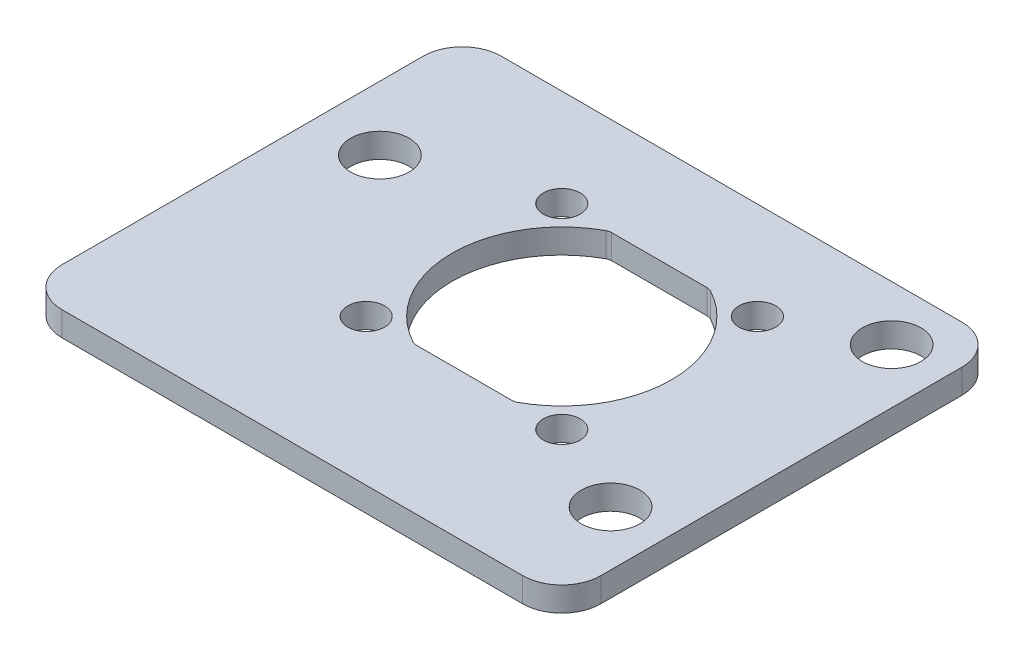
ISO-10303-21;
HEADER;
FILE_DESCRIPTION(('STEP AP214'),'2;1');
FILE_NAME('part.step','',(''),(''),'','','');
FILE_SCHEMA(('AUTOMOTIVE_DESIGN { 1 0 10303 214 1 1 1 1 }'));
ENDSEC;
DATA;
#1=APPLICATION_CONTEXT('core data for automotive mechanical design processes');
#2=APPLICATION_PROTOCOL_DEFINITION('international standard','automotive_design',2000,#1);
#3=PRODUCT_CONTEXT('',#1,'mechanical');
#4=PRODUCT('Part','Part','',(#3));
#5=PRODUCT_RELATED_PRODUCT_CATEGORY('part','',(#4));
#6=PRODUCT_DEFINITION_FORMATION('','',#4);
#7=PRODUCT_DEFINITION_CONTEXT('part definition',#1,'design');
#8=PRODUCT_DEFINITION('design','',#6,#7);
#9=PRODUCT_DEFINITION_SHAPE('','',#8);
#10=(LENGTH_UNIT() NAMED_UNIT(*) SI_UNIT(.MILLI.,.METRE.));
#11=(NAMED_UNIT(*) PLANE_ANGLE_UNIT() SI_UNIT($,.RADIAN.));
#12=(NAMED_UNIT(*) SI_UNIT($,.STERADIAN.) SOLID_ANGLE_UNIT());
#13=UNCERTAINTY_MEASURE_WITH_UNIT(LENGTH_MEASURE(1.E-05),#10,'distance_accuracy_value','');
#14=(GEOMETRIC_REPRESENTATION_CONTEXT(3) GLOBAL_UNCERTAINTY_ASSIGNED_CONTEXT((#13)) GLOBAL_UNIT_ASSIGNED_CONTEXT((#10,
#11,#12)) REPRESENTATION_CONTEXT('',''));
#15=CARTESIAN_POINT('',(0.,0.,0.));
#16=DIRECTION('',(0.,0.,1.));
#17=DIRECTION('',(1.,0.,0.));
#18=AXIS2_PLACEMENT_3D('',#15,#16,#17);
#19=CARTESIAN_POINT('',(0.,1.5875,0.));
#20=DIRECTION('',(0.,-1.,0.));
#21=DIRECTION('',(0.,0.,-1.));
#22=AXIS2_PLACEMENT_3D('',#19,#20,#21);
#23=CYLINDRICAL_SURFACE('',#22,7.1374);
#24=CARTESIAN_POINT('',(0.,1.5875,0.));
#25=DIRECTION('',(0.,1.,0.));
#26=DIRECTION('',(0.,0.,1.));
#27=AXIS2_PLACEMENT_3D('',#24,#25,#26);
#28=CIRCLE('',#27,7.1374);
#29=CARTESIAN_POINT('',(3.40450092347453,1.5875,6.27310546874999));
#30=VERTEX_POINT('',#29);
#31=CARTESIAN_POINT('',(3.40450092347453,1.5875,-6.27310546875));
#32=VERTEX_POINT('',#31);
#33=EDGE_CURVE('E179',#30,#32,#28,.T.);
#34=ORIENTED_EDGE('',*,*,#33,.T.);
#35=DIRECTION('',(0.,-1.,0.));
#36=VECTOR('',#35,1.);
#37=CARTESIAN_POINT('',(3.40450092347453,1.5875,-6.27310546875001));
#38=LINE('',#37,#36);
#39=CARTESIAN_POINT('',(3.40450092347453,0.,-6.27310546875));
#40=VERTEX_POINT('',#39);
#41=EDGE_CURVE('E201',#32,#40,#38,.T.);
#42=ORIENTED_EDGE('',*,*,#41,.T.);
#43=CARTESIAN_POINT('',(0.,0.,0.));
#44=DIRECTION('',(0.,1.,0.));
#45=DIRECTION('',(0.,0.,1.));
#46=AXIS2_PLACEMENT_3D('',#43,#44,#45);
#47=CIRCLE('',#46,7.1374);
#48=CARTESIAN_POINT('',(3.40450092347453,0.,6.27310546874999));
#49=VERTEX_POINT('',#48);
#50=EDGE_CURVE('E180',#49,#40,#47,.T.);
#51=ORIENTED_EDGE('',*,*,#50,.F.);
#52=DIRECTION('',(0.,-1.,0.));
#53=VECTOR('',#52,1.);
#54=CARTESIAN_POINT('',(3.40450092347453,1.5875,6.27310546874999));
#55=LINE('',#54,#53);
#56=EDGE_CURVE('E197',#49,#30,#55,.F.);
#57=ORIENTED_EDGE('',*,*,#56,.T.);
#58=EDGE_LOOP('',(#34,#42,#51,#57));
#59=FACE_BOUND('',#58,.T.);
#60=ADVANCED_FACE('F39',(#59),#23,.F.);
#61=CARTESIAN_POINT('',(0.,1.5875,0.));
#62=DIRECTION('',(0.,-1.,0.));
#63=DIRECTION('',(0.,0.,-1.));
#64=AXIS2_PLACEMENT_3D('',#61,#62,#63);
#65=PLANE('',#64);
#66=CARTESIAN_POINT('',(-15.0096592899373,1.5875,-3.175));
#67=DIRECTION('',(0.,-1.,0.));
#68=DIRECTION('',(0.,0.,1.));
#69=AXIS2_PLACEMENT_3D('',#66,#67,#68);
#70=CIRCLE('',#69,1.905);
#71=CARTESIAN_POINT('',(-15.0096592899373,1.5875,-1.27));
#72=VERTEX_POINT('',#71);
#73=EDGE_CURVE('E381',#72,#72,#70,.T.);
#74=ORIENTED_EDGE('',*,*,#73,.T.);
#75=EDGE_LOOP('',(#74));
#76=FACE_BOUND('',#75,.T.);
#77=DIRECTION('',(0.,0.,-1.));
#78=VECTOR('',#77,1.);
#79=CARTESIAN_POINT('',(15.875,1.5875,12.7));
#80=LINE('',#79,#78);
#81=CARTESIAN_POINT('',(15.875,1.5875,13.335));
#82=VERTEX_POINT('',#81);
#83=CARTESIAN_POINT('',(15.875,1.5875,-10.16));
#84=VERTEX_POINT('',#83);
#85=EDGE_CURVE('E350',#82,#84,#80,.T.);
#86=ORIENTED_EDGE('',*,*,#85,.T.);
#87=CARTESIAN_POINT('',(13.335,1.5875,-10.16));
#88=DIRECTION('',(0.,-1.,0.));
#89=DIRECTION('',(0.,0.,-1.));
#90=AXIS2_PLACEMENT_3D('',#87,#88,#89);
#91=CIRCLE('',#90,2.54);
#92=CARTESIAN_POINT('',(13.335,1.5875,-12.7));
#93=VERTEX_POINT('',#92);
#94=EDGE_CURVE('E263',#84,#93,#91,.F.);
#95=ORIENTED_EDGE('',*,*,#94,.T.);
#96=DIRECTION('',(-1.,0.,0.));
#97=VECTOR('',#96,1.);
#98=CARTESIAN_POINT('',(-15.875,1.5875,-12.7));
#99=LINE('',#98,#97);
#100=CARTESIAN_POINT('',(-16.637,1.5875,-12.7));
#101=VERTEX_POINT('',#100);
#102=EDGE_CURVE('E191',#93,#101,#99,.T.);
#103=ORIENTED_EDGE('',*,*,#102,.T.);
#104=CARTESIAN_POINT('',(-16.637,1.5875,-10.16));
#105=DIRECTION('',(0.,-1.,0.));
#106=DIRECTION('',(0.,0.,-1.));
#107=AXIS2_PLACEMENT_3D('',#104,#105,#106);
#108=CIRCLE('',#107,2.54);
#109=CARTESIAN_POINT('',(-19.177,1.5875,-10.16));
#110=VERTEX_POINT('',#109);
#111=EDGE_CURVE('E260',#101,#110,#108,.F.);
#112=ORIENTED_EDGE('',*,*,#111,.T.);
#113=DIRECTION('',(0.,0.,1.));
#114=VECTOR('',#113,1.);
#115=CARTESIAN_POINT('',(-19.177,1.5875,-12.7));
#116=LINE('',#115,#114);
#117=CARTESIAN_POINT('',(-19.177,1.5875,13.335));
#118=VERTEX_POINT('',#117);
#119=EDGE_CURVE('E374',#110,#118,#116,.T.);
#120=ORIENTED_EDGE('',*,*,#119,.T.);
#121=CARTESIAN_POINT('',(-16.637,1.5875,13.335));
#122=DIRECTION('',(0.,-1.,0.));
#123=DIRECTION('',(0.,0.,-1.));
#124=AXIS2_PLACEMENT_3D('',#121,#122,#123);
#125=CIRCLE('',#124,2.54);
#126=CARTESIAN_POINT('',(-16.637,1.5875,15.875));
#127=VERTEX_POINT('',#126);
#128=EDGE_CURVE('E63',#118,#127,#125,.F.);
#129=ORIENTED_EDGE('',*,*,#128,.T.);
#130=DIRECTION('',(1.,0.,0.));
#131=VECTOR('',#130,1.);
#132=CARTESIAN_POINT('',(-15.875,1.5875,15.875));
#133=LINE('',#132,#131);
#134=CARTESIAN_POINT('',(13.335,1.5875,15.875));
#135=VERTEX_POINT('',#134);
#136=EDGE_CURVE('E276',#127,#135,#133,.T.);
#137=ORIENTED_EDGE('',*,*,#136,.T.);
#138=CARTESIAN_POINT('',(13.335,1.5875,13.335));
#139=DIRECTION('',(0.,-1.,0.));
#140=DIRECTION('',(0.,0.,-1.));
#141=AXIS2_PLACEMENT_3D('',#138,#139,#140);
#142=CIRCLE('',#141,2.54);
#143=EDGE_CURVE('E55',#135,#82,#142,.F.);
#144=ORIENTED_EDGE('',*,*,#143,.T.);
#145=EDGE_LOOP('',(#86,#95,#103,#112,#120,#129,#137,#144));
#146=FACE_BOUND('',#145,.T.);
#147=CARTESIAN_POINT('',(-3.40450092347451,1.5875,-6.27310546875));
#148=VERTEX_POINT('',#147);
#149=CARTESIAN_POINT('',(-3.40450092347451,1.5875,6.27310546874999));
#150=VERTEX_POINT('',#149);
#151=EDGE_CURVE('E346',#148,#150,#28,.T.);
#152=ORIENTED_EDGE('',*,*,#151,.F.);
#153=CARTESIAN_POINT('',(-3.10160938224012,1.5875,-5.71500000000001));
#154=DIRECTION('',(0.,-1.,0.));
#155=DIRECTION('',(0.,0.,-1.));
#156=AXIS2_PLACEMENT_3D('',#153,#154,#155);
#157=CIRCLE('',#156,0.635);
#158=CARTESIAN_POINT('',(-3.10160938224012,1.5875,-6.35));
#159=VERTEX_POINT('',#158);
#160=EDGE_CURVE('E168',#148,#159,#157,.T.);
#161=ORIENTED_EDGE('',*,*,#160,.T.);
#162=DIRECTION('',(1.,0.,0.));
#163=VECTOR('',#162,1.);
#164=CARTESIAN_POINT('',(-3.25883088852428,1.5875,-6.35));
#165=LINE('',#164,#163);
#166=CARTESIAN_POINT('',(3.10160938224014,1.5875,-6.35));
#167=VERTEX_POINT('',#166);
#168=EDGE_CURVE('E386',#159,#167,#165,.T.);
#169=ORIENTED_EDGE('',*,*,#168,.T.);
#170=CARTESIAN_POINT('',(3.10160938224014,1.5875,-5.71500000000001));
#171=DIRECTION('',(0.,-1.,0.));
#172=DIRECTION('',(0.,0.,-1.));
#173=AXIS2_PLACEMENT_3D('',#170,#171,#172);
#174=CIRCLE('',#173,0.635);
#175=EDGE_CURVE('E167',#167,#32,#174,.T.);
#176=ORIENTED_EDGE('',*,*,#175,.T.);
#177=ORIENTED_EDGE('',*,*,#33,.F.);
#178=CARTESIAN_POINT('',(3.10160938224014,1.5875,5.71499999999999));
#179=DIRECTION('',(0.,-1.,0.));
#180=DIRECTION('',(0.,0.,-1.));
#181=AXIS2_PLACEMENT_3D('',#178,#179,#180);
#182=CIRCLE('',#181,0.635);
#183=CARTESIAN_POINT('',(3.10160938224014,1.5875,6.34999999999999));
#184=VERTEX_POINT('',#183);
#185=EDGE_CURVE('E224',#30,#184,#182,.T.);
#186=ORIENTED_EDGE('',*,*,#185,.T.);
#187=DIRECTION('',(-1.,0.,0.));
#188=VECTOR('',#187,1.);
#189=CARTESIAN_POINT('',(3.25883088852428,1.5875,6.34999999999999));
#190=LINE('',#189,#188);
#191=CARTESIAN_POINT('',(-3.10160938224012,1.5875,6.34999999999999));
#192=VERTEX_POINT('',#191);
#193=EDGE_CURVE('E395',#184,#192,#190,.T.);
#194=ORIENTED_EDGE('',*,*,#193,.T.);
#195=CARTESIAN_POINT('',(-3.10160938224012,1.5875,5.71499999999999));
#196=DIRECTION('',(0.,-1.,0.));
#197=DIRECTION('',(0.,0.,-1.));
#198=AXIS2_PLACEMENT_3D('',#195,#196,#197);
#199=CIRCLE('',#198,0.635);
#200=EDGE_CURVE('E218',#192,#150,#199,.T.);
#201=ORIENTED_EDGE('',*,*,#200,.T.);
#202=EDGE_LOOP('',(#152,#161,#169,#176,#177,#186,#194,#201));
#203=FACE_BOUND('',#202,.T.);
#204=CARTESIAN_POINT('',(-6.36396103067893,1.5875,6.36396103067893));
#205=DIRECTION('',(0.,1.,0.));
#206=DIRECTION('',(0.,0.,1.));
#207=AXIS2_PLACEMENT_3D('',#204,#205,#206);
#208=CIRCLE('',#207,1.2);
#209=CARTESIAN_POINT('',(-6.36396103067893,1.5875,7.56396103067893));
#210=VERTEX_POINT('',#209);
#211=EDGE_CURVE('E337',#210,#210,#208,.T.);
#212=ORIENTED_EDGE('',*,*,#211,.F.);
#213=EDGE_LOOP('',(#212));
#214=FACE_BOUND('',#213,.T.);
#215=CARTESIAN_POINT('',(-6.36396103067893,1.5875,-6.36396103067893));
#216=DIRECTION('',(0.,1.,0.));
#217=DIRECTION('',(0.,0.,1.));
#218=AXIS2_PLACEMENT_3D('',#215,#216,#217);
#219=CIRCLE('',#218,1.2);
#220=CARTESIAN_POINT('',(-6.36396103067893,1.5875,-5.16396103067893));
#221=VERTEX_POINT('',#220);
#222=EDGE_CURVE('E329',#221,#221,#219,.T.);
#223=ORIENTED_EDGE('',*,*,#222,.F.);
#224=EDGE_LOOP('',(#223));
#225=FACE_BOUND('',#224,.T.);
#226=CARTESIAN_POINT('',(6.36396103067893,1.5875,-6.36396103067893));
#227=DIRECTION('',(0.,1.,0.));
#228=DIRECTION('',(0.,0.,1.));
#229=AXIS2_PLACEMENT_3D('',#226,#227,#228);
#230=CIRCLE('',#229,1.2);
#231=CARTESIAN_POINT('',(6.36396103067893,1.5875,-5.16396103067893));
#232=VERTEX_POINT('',#231);
#233=EDGE_CURVE('E321',#232,#232,#230,.T.);
#234=ORIENTED_EDGE('',*,*,#233,.F.);
#235=EDGE_LOOP('',(#234));
#236=FACE_BOUND('',#235,.T.);
#237=CARTESIAN_POINT('',(6.36396103067893,1.5875,6.36396103067893));
#238=DIRECTION('',(0.,1.,0.));
#239=DIRECTION('',(0.,0.,1.));
#240=AXIS2_PLACEMENT_3D('',#237,#238,#239);
#241=CIRCLE('',#240,1.2);
#242=CARTESIAN_POINT('',(6.36396103067893,1.5875,7.56396103067893));
#243=VERTEX_POINT('',#242);
#244=EDGE_CURVE('E313',#243,#243,#241,.T.);
#245=ORIENTED_EDGE('',*,*,#244,.F.);
#246=EDGE_LOOP('',(#245));
#247=FACE_BOUND('',#246,.T.);
#248=CARTESIAN_POINT('',(12.319,1.5875,-9.144));
#249=DIRECTION('',(0.,1.,0.));
#250=DIRECTION('',(0.,0.,1.));
#251=AXIS2_PLACEMENT_3D('',#248,#249,#250);
#252=CIRCLE('',#251,1.905);
#253=CARTESIAN_POINT('',(12.319,1.5875,-7.239));
#254=VERTEX_POINT('',#253);
#255=EDGE_CURVE('E305',#254,#254,#252,.T.);
#256=ORIENTED_EDGE('',*,*,#255,.F.);
#257=EDGE_LOOP('',(#256));
#258=FACE_BOUND('',#257,.T.);
#259=CARTESIAN_POINT('',(12.319,1.5875,9.144));
#260=DIRECTION('',(0.,1.,0.));
#261=DIRECTION('',(0.,0.,1.));
#262=AXIS2_PLACEMENT_3D('',#259,#260,#261);
#263=CIRCLE('',#262,1.905);
#264=CARTESIAN_POINT('',(12.319,1.5875,11.049));
#265=VERTEX_POINT('',#264);
#266=EDGE_CURVE('E297',#265,#265,#263,.T.);
#267=ORIENTED_EDGE('',*,*,#266,.F.);
#268=EDGE_LOOP('',(#267));
#269=FACE_BOUND('',#268,.T.);
#270=ADVANCED_FACE('F282',(#76,#146,#203,#214,#225,#236,#247,#258,#269),#65,.F.);
#271=CARTESIAN_POINT('',(0.,0.,0.));
#272=DIRECTION('',(0.,-1.,0.));
#273=DIRECTION('',(0.,0.,-1.));
#274=AXIS2_PLACEMENT_3D('',#271,#272,#273);
#275=PLANE('',#274);
#276=CARTESIAN_POINT('',(-15.0096592899373,0.,-3.175));
#277=DIRECTION('',(0.,-1.,0.));
#278=DIRECTION('',(0.,0.,1.));
#279=AXIS2_PLACEMENT_3D('',#276,#277,#278);
#280=CIRCLE('',#279,1.905);
#281=CARTESIAN_POINT('',(-15.0096592899373,0.,-1.27));
#282=VERTEX_POINT('',#281);
#283=EDGE_CURVE('E286',#282,#282,#280,.T.);
#284=ORIENTED_EDGE('',*,*,#283,.F.);
#285=EDGE_LOOP('',(#284));
#286=FACE_BOUND('',#285,.T.);
#287=CARTESIAN_POINT('',(12.319,0.,-9.144));
#288=DIRECTION('',(0.,1.,0.));
#289=DIRECTION('',(0.,0.,1.));
#290=AXIS2_PLACEMENT_3D('',#287,#288,#289);
#291=CIRCLE('',#290,1.905);
#292=CARTESIAN_POINT('',(12.319,0.,-7.239));
#293=VERTEX_POINT('',#292);
#294=EDGE_CURVE('E301',#293,#293,#291,.T.);
#295=ORIENTED_EDGE('',*,*,#294,.T.);
#296=EDGE_LOOP('',(#295));
#297=FACE_BOUND('',#296,.T.);
#298=CARTESIAN_POINT('',(6.36396103067893,0.,-6.36396103067893));
#299=DIRECTION('',(0.,1.,0.));
#300=DIRECTION('',(0.,0.,1.));
#301=AXIS2_PLACEMENT_3D('',#298,#299,#300);
#302=CIRCLE('',#301,1.2);
#303=CARTESIAN_POINT('',(6.36396103067893,0.,-5.16396103067893));
#304=VERTEX_POINT('',#303);
#305=EDGE_CURVE('E317',#304,#304,#302,.T.);
#306=ORIENTED_EDGE('',*,*,#305,.T.);
#307=EDGE_LOOP('',(#306));
#308=FACE_BOUND('',#307,.T.);
#309=CARTESIAN_POINT('',(-6.36396103067893,0.,6.36396103067893));
#310=DIRECTION('',(0.,1.,0.));
#311=DIRECTION('',(0.,0.,1.));
#312=AXIS2_PLACEMENT_3D('',#309,#310,#311);
#313=CIRCLE('',#312,1.2);
#314=CARTESIAN_POINT('',(-6.36396103067893,0.,7.56396103067893));
#315=VERTEX_POINT('',#314);
#316=EDGE_CURVE('E333',#315,#315,#313,.T.);
#317=ORIENTED_EDGE('',*,*,#316,.T.);
#318=EDGE_LOOP('',(#317));
#319=FACE_BOUND('',#318,.T.);
#320=DIRECTION('',(-1.,0.,0.));
#321=VECTOR('',#320,1.);
#322=CARTESIAN_POINT('',(-15.875,0.,-12.7));
#323=LINE('',#322,#321);
#324=CARTESIAN_POINT('',(13.335,0.,-12.7));
#325=VERTEX_POINT('',#324);
#326=CARTESIAN_POINT('',(-16.637,0.,-12.7));
#327=VERTEX_POINT('',#326);
#328=EDGE_CURVE('E353',#325,#327,#323,.T.);
#329=ORIENTED_EDGE('',*,*,#328,.F.);
#330=CARTESIAN_POINT('',(13.335,0.,-10.16));
#331=DIRECTION('',(0.,-1.,0.));
#332=DIRECTION('',(0.,0.,-1.));
#333=AXIS2_PLACEMENT_3D('',#330,#331,#332);
#334=CIRCLE('',#333,2.54);
#335=CARTESIAN_POINT('',(15.875,0.,-10.16));
#336=VERTEX_POINT('',#335);
#337=EDGE_CURVE('E247',#325,#336,#334,.T.);
#338=ORIENTED_EDGE('',*,*,#337,.T.);
#339=DIRECTION('',(0.,0.,-1.));
#340=VECTOR('',#339,1.);
#341=CARTESIAN_POINT('',(15.875,0.,12.7));
#342=LINE('',#341,#340);
#343=CARTESIAN_POINT('',(15.875,0.,13.335));
#344=VERTEX_POINT('',#343);
#345=EDGE_CURVE('E357',#344,#336,#342,.T.);
#346=ORIENTED_EDGE('',*,*,#345,.F.);
#347=CARTESIAN_POINT('',(13.335,0.,13.335));
#348=DIRECTION('',(0.,-1.,0.));
#349=DIRECTION('',(0.,0.,-1.));
#350=AXIS2_PLACEMENT_3D('',#347,#348,#349);
#351=CIRCLE('',#350,2.54);
#352=CARTESIAN_POINT('',(13.335,0.,15.875));
#353=VERTEX_POINT('',#352);
#354=EDGE_CURVE('E238',#344,#353,#351,.T.);
#355=ORIENTED_EDGE('',*,*,#354,.T.);
#356=DIRECTION('',(1.,0.,0.));
#357=VECTOR('',#356,1.);
#358=CARTESIAN_POINT('',(-15.875,0.,15.875));
#359=LINE('',#358,#357);
#360=CARTESIAN_POINT('',(-16.637,0.,15.875));
#361=VERTEX_POINT('',#360);
#362=EDGE_CURVE('E279',#361,#353,#359,.T.);
#363=ORIENTED_EDGE('',*,*,#362,.F.);
#364=CARTESIAN_POINT('',(-16.637,0.,13.335));
#365=DIRECTION('',(0.,-1.,0.));
#366=DIRECTION('',(0.,0.,-1.));
#367=AXIS2_PLACEMENT_3D('',#364,#365,#366);
#368=CIRCLE('',#367,2.54);
#369=CARTESIAN_POINT('',(-19.177,0.,13.335));
#370=VERTEX_POINT('',#369);
#371=EDGE_CURVE('E241',#361,#370,#368,.T.);
#372=ORIENTED_EDGE('',*,*,#371,.T.);
#373=DIRECTION('',(0.,0.,1.));
#374=VECTOR('',#373,1.);
#375=CARTESIAN_POINT('',(-19.177,0.,-12.7));
#376=LINE('',#375,#374);
#377=CARTESIAN_POINT('',(-19.177,0.,-10.16));
#378=VERTEX_POINT('',#377);
#379=EDGE_CURVE('E293',#378,#370,#376,.T.);
#380=ORIENTED_EDGE('',*,*,#379,.F.);
#381=CARTESIAN_POINT('',(-16.637,0.,-10.16));
#382=DIRECTION('',(0.,-1.,0.));
#383=DIRECTION('',(0.,0.,-1.));
#384=AXIS2_PLACEMENT_3D('',#381,#382,#383);
#385=CIRCLE('',#384,2.54);
#386=EDGE_CURVE('E244',#378,#327,#385,.T.);
#387=ORIENTED_EDGE('',*,*,#386,.T.);
#388=EDGE_LOOP('',(#329,#338,#346,#355,#363,#372,#380,#387));
#389=FACE_BOUND('',#388,.T.);
#390=DIRECTION('',(1.,0.,0.));
#391=VECTOR('',#390,1.);
#392=CARTESIAN_POINT('',(-3.25883088852428,0.,-6.35));
#393=LINE('',#392,#391);
#394=CARTESIAN_POINT('',(-3.10160938224012,0.,-6.35));
#395=VERTEX_POINT('',#394);
#396=CARTESIAN_POINT('',(3.10160938224014,0.,-6.35));
#397=VERTEX_POINT('',#396);
#398=EDGE_CURVE('E162',#395,#397,#393,.T.);
#399=ORIENTED_EDGE('',*,*,#398,.F.);
#400=CARTESIAN_POINT('',(-3.10160938224012,0.,-5.71500000000001));
#401=DIRECTION('',(0.,-1.,0.));
#402=DIRECTION('',(0.,0.,-1.));
#403=AXIS2_PLACEMENT_3D('',#400,#401,#402);
#404=CIRCLE('',#403,0.635);
#405=CARTESIAN_POINT('',(-3.40450092347451,0.,-6.27310546875));
#406=VERTEX_POINT('',#405);
#407=EDGE_CURVE('E155',#395,#406,#404,.F.);
#408=ORIENTED_EDGE('',*,*,#407,.T.);
#409=CARTESIAN_POINT('',(-3.40450092347451,0.,6.27310546874999));
#410=VERTEX_POINT('',#409);
#411=EDGE_CURVE('E159',#406,#410,#47,.T.);
#412=ORIENTED_EDGE('',*,*,#411,.T.);
#413=CARTESIAN_POINT('',(-3.10160938224012,0.,5.71499999999999));
#414=DIRECTION('',(0.,-1.,0.));
#415=DIRECTION('',(0.,0.,-1.));
#416=AXIS2_PLACEMENT_3D('',#413,#414,#415);
#417=CIRCLE('',#416,0.635);
#418=CARTESIAN_POINT('',(-3.10160938224012,0.,6.34999999999999));
#419=VERTEX_POINT('',#418);
#420=EDGE_CURVE('E221',#410,#419,#417,.F.);
#421=ORIENTED_EDGE('',*,*,#420,.T.);
#422=DIRECTION('',(-1.,0.,0.));
#423=VECTOR('',#422,1.);
#424=CARTESIAN_POINT('',(3.25883088852428,0.,6.34999999999999));
#425=LINE('',#424,#423);
#426=CARTESIAN_POINT('',(3.10160938224014,0.,6.34999999999999));
#427=VERTEX_POINT('',#426);
#428=EDGE_CURVE('E393',#427,#419,#425,.T.);
#429=ORIENTED_EDGE('',*,*,#428,.F.);
#430=CARTESIAN_POINT('',(3.10160938224014,0.,5.71499999999999));
#431=DIRECTION('',(0.,-1.,0.));
#432=DIRECTION('',(0.,0.,-1.));
#433=AXIS2_PLACEMENT_3D('',#430,#431,#432);
#434=CIRCLE('',#433,0.635);
#435=EDGE_CURVE('E227',#427,#49,#434,.F.);
#436=ORIENTED_EDGE('',*,*,#435,.T.);
#437=ORIENTED_EDGE('',*,*,#50,.T.);
#438=CARTESIAN_POINT('',(3.10160938224014,0.,-5.71500000000001));
#439=DIRECTION('',(0.,-1.,0.));
#440=DIRECTION('',(0.,0.,-1.));
#441=AXIS2_PLACEMENT_3D('',#438,#439,#440);
#442=CIRCLE('',#441,0.635);
#443=EDGE_CURVE('E215',#40,#397,#442,.F.);
#444=ORIENTED_EDGE('',*,*,#443,.T.);
#445=EDGE_LOOP('',(#399,#408,#412,#421,#429,#436,#437,#444));
#446=FACE_BOUND('',#445,.T.);
#447=CARTESIAN_POINT('',(-6.36396103067893,0.,-6.36396103067893));
#448=DIRECTION('',(0.,1.,0.));
#449=DIRECTION('',(0.,0.,1.));
#450=AXIS2_PLACEMENT_3D('',#447,#448,#449);
#451=CIRCLE('',#450,1.2);
#452=CARTESIAN_POINT('',(-6.36396103067893,0.,-5.16396103067893));
#453=VERTEX_POINT('',#452);
#454=EDGE_CURVE('E325',#453,#453,#451,.T.);
#455=ORIENTED_EDGE('',*,*,#454,.T.);
#456=EDGE_LOOP('',(#455));
#457=FACE_BOUND('',#456,.T.);
#458=CARTESIAN_POINT('',(6.36396103067893,0.,6.36396103067893));
#459=DIRECTION('',(0.,1.,0.));
#460=DIRECTION('',(0.,0.,1.));
#461=AXIS2_PLACEMENT_3D('',#458,#459,#460);
#462=CIRCLE('',#461,1.2);
#463=CARTESIAN_POINT('',(6.36396103067893,0.,7.56396103067893));
#464=VERTEX_POINT('',#463);
#465=EDGE_CURVE('E309',#464,#464,#462,.T.);
#466=ORIENTED_EDGE('',*,*,#465,.T.);
#467=EDGE_LOOP('',(#466));
#468=FACE_BOUND('',#467,.T.);
#469=CARTESIAN_POINT('',(12.319,0.,9.144));
#470=DIRECTION('',(0.,1.,0.));
#471=DIRECTION('',(0.,0.,1.));
#472=AXIS2_PLACEMENT_3D('',#469,#470,#471);
#473=CIRCLE('',#472,1.905);
#474=CARTESIAN_POINT('',(12.319,0.,11.049));
#475=VERTEX_POINT('',#474);
#476=EDGE_CURVE('E290',#475,#475,#473,.T.);
#477=ORIENTED_EDGE('',*,*,#476,.T.);
#478=EDGE_LOOP('',(#477));
#479=FACE_BOUND('',#478,.T.);
#480=ADVANCED_FACE('F157',(#286,#297,#308,#319,#389,#446,#457,#468,#479),#275,.T.);
#481=CARTESIAN_POINT('',(15.875,1.5875,12.7));
#482=DIRECTION('',(-1.,0.,0.));
#483=DIRECTION('',(0.,0.,1.));
#484=AXIS2_PLACEMENT_3D('',#481,#482,#483);
#485=PLANE('',#484);
#486=ORIENTED_EDGE('',*,*,#345,.T.);
#487=DIRECTION('',(0.,-1.,0.));
#488=VECTOR('',#487,1.);
#489=CARTESIAN_POINT('',(15.875,1.5875,-10.16));
#490=LINE('',#489,#488);
#491=EDGE_CURVE('E253',#336,#84,#490,.F.);
#492=ORIENTED_EDGE('',*,*,#491,.T.);
#493=ORIENTED_EDGE('',*,*,#85,.F.);
#494=DIRECTION('',(0.,1.,0.));
#495=VECTOR('',#494,1.);
#496=CARTESIAN_POINT('',(15.875,0.,13.335));
#497=LINE('',#496,#495);
#498=EDGE_CURVE('E250',#82,#344,#497,.F.);
#499=ORIENTED_EDGE('',*,*,#498,.T.);
#500=EDGE_LOOP('',(#486,#492,#493,#499));
#501=FACE_BOUND('',#500,.T.);
#502=ADVANCED_FACE('F452',(#501),#485,.F.);
#503=CARTESIAN_POINT('',(-15.875,1.5875,-12.7));
#504=DIRECTION('',(0.,0.,1.));
#505=DIRECTION('',(1.,0.,0.));
#506=AXIS2_PLACEMENT_3D('',#503,#504,#505);
#507=PLANE('',#506);
#508=ORIENTED_EDGE('',*,*,#102,.F.);
#509=DIRECTION('',(0.,-1.,0.));
#510=VECTOR('',#509,1.);
#511=CARTESIAN_POINT('',(13.335,1.5875,-12.7));
#512=LINE('',#511,#510);
#513=EDGE_CURVE('E234',#93,#325,#512,.T.);
#514=ORIENTED_EDGE('',*,*,#513,.T.);
#515=ORIENTED_EDGE('',*,*,#328,.T.);
#516=DIRECTION('',(0.,1.,0.));
#517=VECTOR('',#516,1.);
#518=CARTESIAN_POINT('',(-16.637,1.5875,-12.7));
#519=LINE('',#518,#517);
#520=EDGE_CURVE('E230',#327,#101,#519,.T.);
#521=ORIENTED_EDGE('',*,*,#520,.T.);
#522=EDGE_LOOP('',(#508,#514,#515,#521));
#523=FACE_BOUND('',#522,.T.);
#524=ADVANCED_FACE('F366',(#523),#507,.F.);
#525=ORIENTED_EDGE('',*,*,#411,.F.);
#526=DIRECTION('',(0.,-1.,0.));
#527=VECTOR('',#526,1.);
#528=CARTESIAN_POINT('',(-3.40450092347451,1.5875,-6.27310546875001));
#529=LINE('',#528,#527);
#530=EDGE_CURVE('E174',#406,#148,#529,.F.);
#531=ORIENTED_EDGE('',*,*,#530,.T.);
#532=ORIENTED_EDGE('',*,*,#151,.T.);
#533=DIRECTION('',(0.,-1.,0.));
#534=VECTOR('',#533,1.);
#535=CARTESIAN_POINT('',(-3.40450092347451,1.5875,6.27310546874999));
#536=LINE('',#535,#534);
#537=EDGE_CURVE('E177',#150,#410,#536,.T.);
#538=ORIENTED_EDGE('',*,*,#537,.T.);
#539=EDGE_LOOP('',(#525,#531,#532,#538));
#540=FACE_BOUND('',#539,.T.);
#541=ADVANCED_FACE('F172',(#540),#23,.F.);
#542=CARTESIAN_POINT('',(-6.36396103067893,1.5875,6.36396103067893));
#543=DIRECTION('',(0.,-1.,0.));
#544=DIRECTION('',(0.,0.,-1.));
#545=AXIS2_PLACEMENT_3D('',#542,#543,#544);
#546=CYLINDRICAL_SURFACE('',#545,1.2);
#547=ORIENTED_EDGE('',*,*,#211,.T.);
#548=EDGE_LOOP('',(#547));
#549=FACE_BOUND('',#548,.T.);
#550=ORIENTED_EDGE('',*,*,#316,.F.);
#551=EDGE_LOOP('',(#550));
#552=FACE_BOUND('',#551,.T.);
#553=ADVANCED_FACE('F445',(#549,#552),#546,.F.);
#554=CARTESIAN_POINT('',(-6.36396103067893,1.5875,-6.36396103067893));
#555=DIRECTION('',(0.,-1.,0.));
#556=DIRECTION('',(0.,0.,-1.));
#557=AXIS2_PLACEMENT_3D('',#554,#555,#556);
#558=CYLINDRICAL_SURFACE('',#557,1.2);
#559=ORIENTED_EDGE('',*,*,#222,.T.);
#560=EDGE_LOOP('',(#559));
#561=FACE_BOUND('',#560,.T.);
#562=ORIENTED_EDGE('',*,*,#454,.F.);
#563=EDGE_LOOP('',(#562));
#564=FACE_BOUND('',#563,.T.);
#565=ADVANCED_FACE('F450',(#561,#564),#558,.F.);
#566=CARTESIAN_POINT('',(6.36396103067893,1.5875,-6.36396103067893));
#567=DIRECTION('',(0.,-1.,0.));
#568=DIRECTION('',(0.,0.,-1.));
#569=AXIS2_PLACEMENT_3D('',#566,#567,#568);
#570=CYLINDRICAL_SURFACE('',#569,1.2);
#571=ORIENTED_EDGE('',*,*,#233,.T.);
#572=EDGE_LOOP('',(#571));
#573=FACE_BOUND('',#572,.T.);
#574=ORIENTED_EDGE('',*,*,#305,.F.);
#575=EDGE_LOOP('',(#574));
#576=FACE_BOUND('',#575,.T.);
#577=ADVANCED_FACE('F497',(#573,#576),#570,.F.);
#578=CARTESIAN_POINT('',(6.36396103067893,1.5875,6.36396103067893));
#579=DIRECTION('',(0.,-1.,0.));
#580=DIRECTION('',(0.,0.,-1.));
#581=AXIS2_PLACEMENT_3D('',#578,#579,#580);
#582=CYLINDRICAL_SURFACE('',#581,1.2);
#583=ORIENTED_EDGE('',*,*,#244,.T.);
#584=EDGE_LOOP('',(#583));
#585=FACE_BOUND('',#584,.T.);
#586=ORIENTED_EDGE('',*,*,#465,.F.);
#587=EDGE_LOOP('',(#586));
#588=FACE_BOUND('',#587,.T.);
#589=ADVANCED_FACE('F499',(#585,#588),#582,.F.);
#590=CARTESIAN_POINT('',(12.319,1.5875,-9.144));
#591=DIRECTION('',(0.,-1.,0.));
#592=DIRECTION('',(0.,0.,-1.));
#593=AXIS2_PLACEMENT_3D('',#590,#591,#592);
#594=CYLINDRICAL_SURFACE('',#593,1.905);
#595=ORIENTED_EDGE('',*,*,#255,.T.);
#596=EDGE_LOOP('',(#595));
#597=FACE_BOUND('',#596,.T.);
#598=ORIENTED_EDGE('',*,*,#294,.F.);
#599=EDGE_LOOP('',(#598));
#600=FACE_BOUND('',#599,.T.);
#601=ADVANCED_FACE('F506',(#597,#600),#594,.F.);
#602=CARTESIAN_POINT('',(12.319,1.5875,9.144));
#603=DIRECTION('',(0.,-1.,0.));
#604=DIRECTION('',(0.,0.,-1.));
#605=AXIS2_PLACEMENT_3D('',#602,#603,#604);
#606=CYLINDRICAL_SURFACE('',#605,1.905);
#607=ORIENTED_EDGE('',*,*,#266,.T.);
#608=EDGE_LOOP('',(#607));
#609=FACE_BOUND('',#608,.T.);
#610=ORIENTED_EDGE('',*,*,#476,.F.);
#611=EDGE_LOOP('',(#610));
#612=FACE_BOUND('',#611,.T.);
#613=ADVANCED_FACE('F514',(#609,#612),#606,.F.);
#614=CARTESIAN_POINT('',(-15.875,0.,15.875));
#615=DIRECTION('',(0.,0.,1.));
#616=DIRECTION('',(1.,0.,0.));
#617=AXIS2_PLACEMENT_3D('',#614,#615,#616);
#618=PLANE('',#617);
#619=ORIENTED_EDGE('',*,*,#136,.F.);
#620=DIRECTION('',(0.,1.,0.));
#621=VECTOR('',#620,1.);
#622=CARTESIAN_POINT('',(-16.637,0.,15.875));
#623=LINE('',#622,#621);
#624=EDGE_CURVE('E11',#127,#361,#623,.F.);
#625=ORIENTED_EDGE('',*,*,#624,.T.);
#626=ORIENTED_EDGE('',*,*,#362,.T.);
#627=DIRECTION('',(0.,1.,0.));
#628=VECTOR('',#627,1.);
#629=CARTESIAN_POINT('',(13.335,1.5875,15.875));
#630=LINE('',#629,#628);
#631=EDGE_CURVE('E48',#353,#135,#630,.T.);
#632=ORIENTED_EDGE('',*,*,#631,.T.);
#633=EDGE_LOOP('',(#619,#625,#626,#632));
#634=FACE_BOUND('',#633,.T.);
#635=ADVANCED_FACE('F275',(#634),#618,.T.);
#636=CARTESIAN_POINT('',(-19.177,0.,-12.7));
#637=DIRECTION('',(-1.,0.,0.));
#638=DIRECTION('',(0.,0.,1.));
#639=AXIS2_PLACEMENT_3D('',#636,#637,#638);
#640=PLANE('',#639);
#641=ORIENTED_EDGE('',*,*,#119,.F.);
#642=DIRECTION('',(0.,1.,0.));
#643=VECTOR('',#642,1.);
#644=CARTESIAN_POINT('',(-19.177,0.,-10.16));
#645=LINE('',#644,#643);
#646=EDGE_CURVE('E270',#110,#378,#645,.F.);
#647=ORIENTED_EDGE('',*,*,#646,.T.);
#648=ORIENTED_EDGE('',*,*,#379,.T.);
#649=DIRECTION('',(0.,1.,0.));
#650=VECTOR('',#649,1.);
#651=CARTESIAN_POINT('',(-19.177,0.,13.335));
#652=LINE('',#651,#650);
#653=EDGE_CURVE('E266',#370,#118,#652,.T.);
#654=ORIENTED_EDGE('',*,*,#653,.T.);
#655=EDGE_LOOP('',(#641,#647,#648,#654));
#656=FACE_BOUND('',#655,.T.);
#657=ADVANCED_FACE('F376',(#656),#640,.T.);
#658=CARTESIAN_POINT('',(-15.0096592899373,0.,-3.175));
#659=DIRECTION('',(0.,1.,0.));
#660=DIRECTION('',(0.,0.,1.));
#661=AXIS2_PLACEMENT_3D('',#658,#659,#660);
#662=CYLINDRICAL_SURFACE('',#661,1.905);
#663=ORIENTED_EDGE('',*,*,#73,.F.);
#664=EDGE_LOOP('',(#663));
#665=FACE_BOUND('',#664,.T.);
#666=ORIENTED_EDGE('',*,*,#283,.T.);
#667=EDGE_LOOP('',(#666));
#668=FACE_BOUND('',#667,.T.);
#669=ADVANCED_FACE('F427',(#665,#668),#662,.F.);
#670=CARTESIAN_POINT('',(-3.25883088852428,0.,-6.35));
#671=DIRECTION('',(0.,0.,1.));
#672=DIRECTION('',(1.,0.,0.));
#673=AXIS2_PLACEMENT_3D('',#670,#671,#672);
#674=PLANE('',#673);
#675=ORIENTED_EDGE('',*,*,#168,.F.);
#676=DIRECTION('',(0.,1.,0.));
#677=VECTOR('',#676,1.);
#678=CARTESIAN_POINT('',(-3.10160938224012,0.,-6.35));
#679=LINE('',#678,#677);
#680=EDGE_CURVE('E189',#159,#395,#679,.F.);
#681=ORIENTED_EDGE('',*,*,#680,.T.);
#682=ORIENTED_EDGE('',*,*,#398,.T.);
#683=DIRECTION('',(0.,1.,0.));
#684=VECTOR('',#683,1.);
#685=CARTESIAN_POINT('',(3.10160938224014,1.5875,-6.35));
#686=LINE('',#685,#684);
#687=EDGE_CURVE('E184',#397,#167,#686,.T.);
#688=ORIENTED_EDGE('',*,*,#687,.T.);
#689=EDGE_LOOP('',(#675,#681,#682,#688));
#690=FACE_BOUND('',#689,.T.);
#691=ADVANCED_FACE('F425',(#690),#674,.T.);
#692=CARTESIAN_POINT('',(3.25883088852428,0.,6.34999999999999));
#693=DIRECTION('',(0.,0.,-1.));
#694=DIRECTION('',(-1.,0.,0.));
#695=AXIS2_PLACEMENT_3D('',#692,#693,#694);
#696=PLANE('',#695);
#697=ORIENTED_EDGE('',*,*,#428,.T.);
#698=DIRECTION('',(0.,1.,0.));
#699=VECTOR('',#698,1.);
#700=CARTESIAN_POINT('',(-3.10160938224012,1.5875,6.34999999999999));
#701=LINE('',#700,#699);
#702=EDGE_CURVE('E207',#419,#192,#701,.T.);
#703=ORIENTED_EDGE('',*,*,#702,.T.);
#704=ORIENTED_EDGE('',*,*,#193,.F.);
#705=DIRECTION('',(0.,1.,0.));
#706=VECTOR('',#705,1.);
#707=CARTESIAN_POINT('',(3.10160938224014,0.,6.34999999999999));
#708=LINE('',#707,#706);
#709=EDGE_CURVE('E204',#184,#427,#708,.F.);
#710=ORIENTED_EDGE('',*,*,#709,.T.);
#711=EDGE_LOOP('',(#697,#703,#704,#710));
#712=FACE_BOUND('',#711,.T.);
#713=ADVANCED_FACE('F404',(#712),#696,.T.);
#714=CARTESIAN_POINT('',(-3.10160938224012,1.5875,-5.71500000000001));
#715=DIRECTION('',(0.,-1.,0.));
#716=DIRECTION('',(0.,0.,-1.));
#717=AXIS2_PLACEMENT_3D('',#714,#715,#716);
#718=CYLINDRICAL_SURFACE('',#717,0.635);
#719=ORIENTED_EDGE('',*,*,#407,.F.);
#720=ORIENTED_EDGE('',*,*,#680,.F.);
#721=ORIENTED_EDGE('',*,*,#160,.F.);
#722=ORIENTED_EDGE('',*,*,#530,.F.);
#723=EDGE_LOOP('',(#719,#720,#721,#722));
#724=FACE_BOUND('',#723,.T.);
#725=ADVANCED_FACE('F182',(#724),#718,.F.);
#726=CARTESIAN_POINT('',(3.10160938224014,1.5875,-5.71500000000001));
#727=DIRECTION('',(0.,-1.,0.));
#728=DIRECTION('',(0.,0.,-1.));
#729=AXIS2_PLACEMENT_3D('',#726,#727,#728);
#730=CYLINDRICAL_SURFACE('',#729,0.635);
#731=ORIENTED_EDGE('',*,*,#443,.F.);
#732=ORIENTED_EDGE('',*,*,#41,.F.);
#733=ORIENTED_EDGE('',*,*,#175,.F.);
#734=ORIENTED_EDGE('',*,*,#687,.F.);
#735=EDGE_LOOP('',(#731,#732,#733,#734));
#736=FACE_BOUND('',#735,.T.);
#737=ADVANCED_FACE('F421',(#736),#730,.F.);
#738=CARTESIAN_POINT('',(-3.10160938224012,1.5875,5.71499999999999));
#739=DIRECTION('',(0.,-1.,0.));
#740=DIRECTION('',(0.,0.,-1.));
#741=AXIS2_PLACEMENT_3D('',#738,#739,#740);
#742=CYLINDRICAL_SURFACE('',#741,0.635);
#743=ORIENTED_EDGE('',*,*,#420,.F.);
#744=ORIENTED_EDGE('',*,*,#537,.F.);
#745=ORIENTED_EDGE('',*,*,#200,.F.);
#746=ORIENTED_EDGE('',*,*,#702,.F.);
#747=EDGE_LOOP('',(#743,#744,#745,#746));
#748=FACE_BOUND('',#747,.T.);
#749=ADVANCED_FACE('F409',(#748),#742,.F.);
#750=CARTESIAN_POINT('',(3.10160938224014,1.5875,5.71499999999999));
#751=DIRECTION('',(0.,-1.,0.));
#752=DIRECTION('',(0.,0.,-1.));
#753=AXIS2_PLACEMENT_3D('',#750,#751,#752);
#754=CYLINDRICAL_SURFACE('',#753,0.635);
#755=ORIENTED_EDGE('',*,*,#435,.F.);
#756=ORIENTED_EDGE('',*,*,#709,.F.);
#757=ORIENTED_EDGE('',*,*,#185,.F.);
#758=ORIENTED_EDGE('',*,*,#56,.F.);
#759=EDGE_LOOP('',(#755,#756,#757,#758));
#760=FACE_BOUND('',#759,.T.);
#761=ADVANCED_FACE('F414',(#760),#754,.F.);
#762=CARTESIAN_POINT('',(13.335,1.5875,-10.16));
#763=DIRECTION('',(0.,-1.,0.));
#764=DIRECTION('',(0.,0.,-1.));
#765=AXIS2_PLACEMENT_3D('',#762,#763,#764);
#766=CYLINDRICAL_SURFACE('',#765,2.54);
#767=ORIENTED_EDGE('',*,*,#94,.F.);
#768=ORIENTED_EDGE('',*,*,#491,.F.);
#769=ORIENTED_EDGE('',*,*,#337,.F.);
#770=ORIENTED_EDGE('',*,*,#513,.F.);
#771=EDGE_LOOP('',(#767,#768,#769,#770));
#772=FACE_BOUND('',#771,.T.);
#773=ADVANCED_FACE('F469',(#772),#766,.T.);
#774=CARTESIAN_POINT('',(-16.637,1.5875,-10.16));
#775=DIRECTION('',(0.,-1.,0.));
#776=DIRECTION('',(0.,0.,-1.));
#777=AXIS2_PLACEMENT_3D('',#774,#775,#776);
#778=CYLINDRICAL_SURFACE('',#777,2.54);
#779=ORIENTED_EDGE('',*,*,#386,.F.);
#780=ORIENTED_EDGE('',*,*,#646,.F.);
#781=ORIENTED_EDGE('',*,*,#111,.F.);
#782=ORIENTED_EDGE('',*,*,#520,.F.);
#783=EDGE_LOOP('',(#779,#780,#781,#782));
#784=FACE_BOUND('',#783,.T.);
#785=ADVANCED_FACE('F371',(#784),#778,.T.);
#786=CARTESIAN_POINT('',(-16.637,0.,13.335));
#787=DIRECTION('',(0.,1.,0.));
#788=DIRECTION('',(0.,0.,1.));
#789=AXIS2_PLACEMENT_3D('',#786,#787,#788);
#790=CYLINDRICAL_SURFACE('',#789,2.54);
#791=ORIENTED_EDGE('',*,*,#371,.F.);
#792=ORIENTED_EDGE('',*,*,#624,.F.);
#793=ORIENTED_EDGE('',*,*,#128,.F.);
#794=ORIENTED_EDGE('',*,*,#653,.F.);
#795=EDGE_LOOP('',(#791,#792,#793,#794));
#796=FACE_BOUND('',#795,.T.);
#797=ADVANCED_FACE('F474',(#796),#790,.T.);
#798=CARTESIAN_POINT('',(13.335,0.,13.335));
#799=DIRECTION('',(0.,-1.,0.));
#800=DIRECTION('',(0.,0.,-1.));
#801=AXIS2_PLACEMENT_3D('',#798,#799,#800);
#802=CYLINDRICAL_SURFACE('',#801,2.54);
#803=ORIENTED_EDGE('',*,*,#354,.F.);
#804=ORIENTED_EDGE('',*,*,#498,.F.);
#805=ORIENTED_EDGE('',*,*,#143,.F.);
#806=ORIENTED_EDGE('',*,*,#631,.F.);
#807=EDGE_LOOP('',(#803,#804,#805,#806));
#808=FACE_BOUND('',#807,.T.);
#809=ADVANCED_FACE('F41',(#808),#802,.T.);
#810=CLOSED_SHELL('',(#60,#270,#480,#502,#524,#541,#553,#565,#577,#589,#601,#613,#635,#657,#669,
#691,#713,#725,#737,#749,#761,#773,#785,#797,#809));
#811=MANIFOLD_SOLID_BREP('B2',#810);
#812=ADVANCED_BREP_SHAPE_REPRESENTATION('',(#18,#811),#14);
#813=SHAPE_DEFINITION_REPRESENTATION(#9,#812);
ENDSEC;
END-ISO-10303-21;
